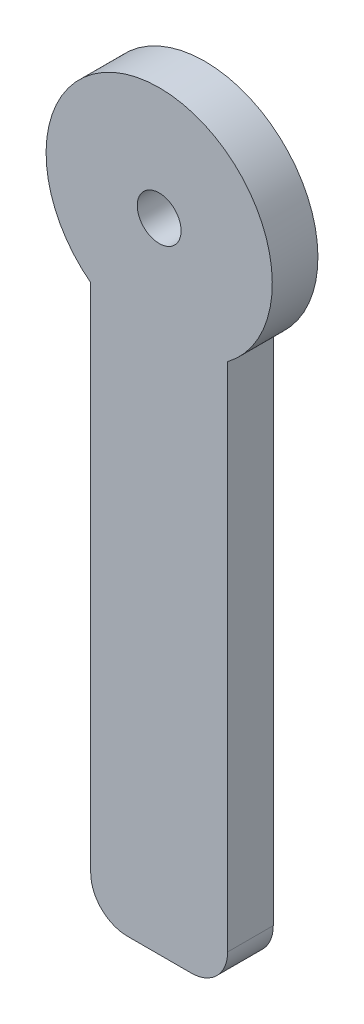
ISO-10303-21;
HEADER;
FILE_DESCRIPTION(('STEP AP214'),'2;1');
FILE_NAME('part.step','',(''),(''),'','','');
FILE_SCHEMA(('AUTOMOTIVE_DESIGN { 1 0 10303 214 1 1 1 1 }'));
ENDSEC;
DATA;
#1=APPLICATION_CONTEXT('core data for automotive mechanical design processes');
#2=APPLICATION_PROTOCOL_DEFINITION('international standard','automotive_design',2000,#1);
#3=PRODUCT_CONTEXT('',#1,'mechanical');
#4=PRODUCT('Part','Part','',(#3));
#5=PRODUCT_RELATED_PRODUCT_CATEGORY('part','',(#4));
#6=PRODUCT_DEFINITION_FORMATION('','',#4);
#7=PRODUCT_DEFINITION_CONTEXT('part definition',#1,'design');
#8=PRODUCT_DEFINITION('design','',#6,#7);
#9=PRODUCT_DEFINITION_SHAPE('','',#8);
#10=(LENGTH_UNIT() NAMED_UNIT(*) SI_UNIT(.MILLI.,.METRE.));
#11=(NAMED_UNIT(*) PLANE_ANGLE_UNIT() SI_UNIT($,.RADIAN.));
#12=(NAMED_UNIT(*) SI_UNIT($,.STERADIAN.) SOLID_ANGLE_UNIT());
#13=UNCERTAINTY_MEASURE_WITH_UNIT(LENGTH_MEASURE(1.E-05),#10,'distance_accuracy_value','');
#14=(GEOMETRIC_REPRESENTATION_CONTEXT(3) GLOBAL_UNCERTAINTY_ASSIGNED_CONTEXT((#13)) GLOBAL_UNIT_ASSIGNED_CONTEXT((#10,
#11,#12)) REPRESENTATION_CONTEXT('',''));
#15=CARTESIAN_POINT('',(0.,0.,0.));
#16=DIRECTION('',(0.,0.,1.));
#17=DIRECTION('',(1.,0.,0.));
#18=AXIS2_PLACEMENT_3D('',#15,#16,#17);
#19=CARTESIAN_POINT('',(-4.7625,44.362984271777,3.175));
#20=DIRECTION('',(0.,0.,-1.));
#21=DIRECTION('',(-1.,0.,0.));
#22=AXIS2_PLACEMENT_3D('',#19,#20,#21);
#23=CYLINDRICAL_SURFACE('',#22,7.86806064024209);
#24=CARTESIAN_POINT('',(-4.7625,44.362984271777,0.));
#25=DIRECTION('',(0.,0.,1.));
#26=DIRECTION('',(-1.,0.,0.));
#27=AXIS2_PLACEMENT_3D('',#24,#25,#26);
#28=CIRCLE('',#27,7.86806064024209);
#29=CARTESIAN_POINT('',(0.,38.1,0.));
#30=VERTEX_POINT('',#29);
#31=CARTESIAN_POINT('',(-9.525,38.1,0.));
#32=VERTEX_POINT('',#31);
#33=EDGE_CURVE('E128',#30,#32,#28,.T.);
#34=ORIENTED_EDGE('',*,*,#33,.T.);
#35=DIRECTION('',(0.,0.,-1.));
#36=VECTOR('',#35,1.);
#37=CARTESIAN_POINT('',(-9.525,38.1,3.175));
#38=LINE('',#37,#36);
#39=CARTESIAN_POINT('',(-9.525,38.1,3.175));
#40=VERTEX_POINT('',#39);
#41=EDGE_CURVE('E11',#40,#32,#38,.T.);
#42=ORIENTED_EDGE('',*,*,#41,.F.);
#43=CARTESIAN_POINT('',(-4.7625,44.362984271777,3.175));
#44=DIRECTION('',(0.,0.,1.));
#45=DIRECTION('',(-1.,0.,0.));
#46=AXIS2_PLACEMENT_3D('',#43,#44,#45);
#47=CIRCLE('',#46,7.86806064024209);
#48=CARTESIAN_POINT('',(0.,38.1,3.175));
#49=VERTEX_POINT('',#48);
#50=EDGE_CURVE('E145',#49,#40,#47,.T.);
#51=ORIENTED_EDGE('',*,*,#50,.F.);
#52=DIRECTION('',(0.,0.,-1.));
#53=VECTOR('',#52,1.);
#54=CARTESIAN_POINT('',(0.,38.1,3.175));
#55=LINE('',#54,#53);
#56=EDGE_CURVE('E124',#49,#30,#55,.T.);
#57=ORIENTED_EDGE('',*,*,#56,.T.);
#58=EDGE_LOOP('',(#34,#42,#51,#57));
#59=FACE_BOUND('',#58,.T.);
#60=ADVANCED_FACE('F39',(#59),#23,.T.);
#61=CARTESIAN_POINT('',(-9.525,2.54,3.175));
#62=DIRECTION('',(1.,0.,0.));
#63=DIRECTION('',(0.,1.,0.));
#64=AXIS2_PLACEMENT_3D('',#61,#62,#63);
#65=PLANE('',#64);
#66=DIRECTION('',(0.,-1.,0.));
#67=VECTOR('',#66,1.);
#68=CARTESIAN_POINT('',(-9.525,2.54,0.));
#69=LINE('',#68,#67);
#70=CARTESIAN_POINT('',(-9.525,2.54,0.));
#71=VERTEX_POINT('',#70);
#72=EDGE_CURVE('E132',#32,#71,#69,.T.);
#73=ORIENTED_EDGE('',*,*,#72,.T.);
#74=DIRECTION('',(0.,0.,-1.));
#75=VECTOR('',#74,1.);
#76=CARTESIAN_POINT('',(-9.525,2.54,3.175));
#77=LINE('',#76,#75);
#78=CARTESIAN_POINT('',(-9.525,2.54,3.175));
#79=VERTEX_POINT('',#78);
#80=EDGE_CURVE('E48',#79,#71,#77,.T.);
#81=ORIENTED_EDGE('',*,*,#80,.F.);
#82=DIRECTION('',(0.,-1.,0.));
#83=VECTOR('',#82,1.);
#84=CARTESIAN_POINT('',(-9.525,2.54,3.175));
#85=LINE('',#84,#83);
#86=EDGE_CURVE('E93',#40,#79,#85,.T.);
#87=ORIENTED_EDGE('',*,*,#86,.F.);
#88=ORIENTED_EDGE('',*,*,#41,.T.);
#89=EDGE_LOOP('',(#73,#81,#87,#88));
#90=FACE_BOUND('',#89,.T.);
#91=ADVANCED_FACE('F174',(#90),#65,.F.);
#92=CARTESIAN_POINT('',(-6.985,2.54,3.175));
#93=DIRECTION('',(0.,0.,-1.));
#94=DIRECTION('',(-1.,0.,0.));
#95=AXIS2_PLACEMENT_3D('',#92,#93,#94);
#96=CYLINDRICAL_SURFACE('',#95,2.54);
#97=CARTESIAN_POINT('',(-6.985,2.54,0.));
#98=DIRECTION('',(0.,0.,1.));
#99=DIRECTION('',(-1.,0.,0.));
#100=AXIS2_PLACEMENT_3D('',#97,#98,#99);
#101=CIRCLE('',#100,2.54);
#102=CARTESIAN_POINT('',(-6.985,0.,0.));
#103=VERTEX_POINT('',#102);
#104=EDGE_CURVE('E136',#71,#103,#101,.T.);
#105=ORIENTED_EDGE('',*,*,#104,.T.);
#106=DIRECTION('',(0.,0.,-1.));
#107=VECTOR('',#106,1.);
#108=CARTESIAN_POINT('',(-6.985,0.,3.175));
#109=LINE('',#108,#107);
#110=CARTESIAN_POINT('',(-6.985,0.,3.175));
#111=VERTEX_POINT('',#110);
#112=EDGE_CURVE('E117',#111,#103,#109,.T.);
#113=ORIENTED_EDGE('',*,*,#112,.F.);
#114=CARTESIAN_POINT('',(-6.985,2.54,3.175));
#115=DIRECTION('',(0.,0.,1.));
#116=DIRECTION('',(-1.,0.,0.));
#117=AXIS2_PLACEMENT_3D('',#114,#115,#116);
#118=CIRCLE('',#117,2.54);
#119=EDGE_CURVE('E106',#79,#111,#118,.T.);
#120=ORIENTED_EDGE('',*,*,#119,.F.);
#121=ORIENTED_EDGE('',*,*,#80,.T.);
#122=EDGE_LOOP('',(#105,#113,#120,#121));
#123=FACE_BOUND('',#122,.T.);
#124=ADVANCED_FACE('F155',(#123),#96,.T.);
#125=CARTESIAN_POINT('',(-2.54000000000002,0.,3.175));
#126=DIRECTION('',(0.,1.,0.));
#127=DIRECTION('',(-1.,0.,0.));
#128=AXIS2_PLACEMENT_3D('',#125,#126,#127);
#129=PLANE('',#128);
#130=DIRECTION('',(1.,0.,0.));
#131=VECTOR('',#130,1.);
#132=CARTESIAN_POINT('',(-2.54000000000002,0.,0.));
#133=LINE('',#132,#131);
#134=CARTESIAN_POINT('',(-2.54000000000002,0.,0.));
#135=VERTEX_POINT('',#134);
#136=EDGE_CURVE('E115',#103,#135,#133,.T.);
#137=ORIENTED_EDGE('',*,*,#136,.T.);
#138=DIRECTION('',(0.,0.,-1.));
#139=VECTOR('',#138,1.);
#140=CARTESIAN_POINT('',(-2.54000000000002,0.,3.175));
#141=LINE('',#140,#139);
#142=CARTESIAN_POINT('',(-2.54000000000002,0.,3.175));
#143=VERTEX_POINT('',#142);
#144=EDGE_CURVE('E112',#143,#135,#141,.T.);
#145=ORIENTED_EDGE('',*,*,#144,.F.);
#146=DIRECTION('',(1.,0.,0.));
#147=VECTOR('',#146,1.);
#148=CARTESIAN_POINT('',(-2.54000000000002,0.,3.175));
#149=LINE('',#148,#147);
#150=EDGE_CURVE('E100',#111,#143,#149,.T.);
#151=ORIENTED_EDGE('',*,*,#150,.F.);
#152=ORIENTED_EDGE('',*,*,#112,.T.);
#153=EDGE_LOOP('',(#137,#145,#151,#152));
#154=FACE_BOUND('',#153,.T.);
#155=ADVANCED_FACE('F113',(#154),#129,.F.);
#156=CARTESIAN_POINT('',(-2.54,2.54,3.175));
#157=DIRECTION('',(0.,0.,-1.));
#158=DIRECTION('',(-1.,0.,0.));
#159=AXIS2_PLACEMENT_3D('',#156,#157,#158);
#160=CYLINDRICAL_SURFACE('',#159,2.54);
#161=CARTESIAN_POINT('',(-2.54,2.54,0.));
#162=DIRECTION('',(0.,0.,1.));
#163=DIRECTION('',(1.,0.,0.));
#164=AXIS2_PLACEMENT_3D('',#161,#162,#163);
#165=CIRCLE('',#164,2.54);
#166=CARTESIAN_POINT('',(0.,2.54,0.));
#167=VERTEX_POINT('',#166);
#168=EDGE_CURVE('E79',#135,#167,#165,.T.);
#169=ORIENTED_EDGE('',*,*,#168,.T.);
#170=DIRECTION('',(0.,0.,-1.));
#171=VECTOR('',#170,1.);
#172=CARTESIAN_POINT('',(0.,2.54,3.175));
#173=LINE('',#172,#171);
#174=CARTESIAN_POINT('',(0.,2.54,3.175));
#175=VERTEX_POINT('',#174);
#176=EDGE_CURVE('E118',#175,#167,#173,.T.);
#177=ORIENTED_EDGE('',*,*,#176,.F.);
#178=CARTESIAN_POINT('',(-2.54,2.54,3.175));
#179=DIRECTION('',(0.,0.,1.));
#180=DIRECTION('',(1.,0.,0.));
#181=AXIS2_PLACEMENT_3D('',#178,#179,#180);
#182=CIRCLE('',#181,2.54);
#183=EDGE_CURVE('E104',#143,#175,#182,.T.);
#184=ORIENTED_EDGE('',*,*,#183,.F.);
#185=ORIENTED_EDGE('',*,*,#144,.T.);
#186=EDGE_LOOP('',(#169,#177,#184,#185));
#187=FACE_BOUND('',#186,.T.);
#188=ADVANCED_FACE('F120',(#187),#160,.T.);
#189=CARTESIAN_POINT('',(0.,2.54000000000002,3.175));
#190=DIRECTION('',(-1.,0.,0.));
#191=DIRECTION('',(0.,-1.,0.));
#192=AXIS2_PLACEMENT_3D('',#189,#190,#191);
#193=PLANE('',#192);
#194=DIRECTION('',(0.,1.,0.));
#195=VECTOR('',#194,1.);
#196=CARTESIAN_POINT('',(0.,2.54000000000002,0.));
#197=LINE('',#196,#195);
#198=EDGE_CURVE('E85',#167,#30,#197,.T.);
#199=ORIENTED_EDGE('',*,*,#198,.T.);
#200=ORIENTED_EDGE('',*,*,#56,.F.);
#201=DIRECTION('',(0.,1.,0.));
#202=VECTOR('',#201,1.);
#203=CARTESIAN_POINT('',(0.,2.54000000000002,3.175));
#204=LINE('',#203,#202);
#205=EDGE_CURVE('E56',#175,#49,#204,.T.);
#206=ORIENTED_EDGE('',*,*,#205,.F.);
#207=ORIENTED_EDGE('',*,*,#176,.T.);
#208=EDGE_LOOP('',(#199,#200,#206,#207));
#209=FACE_BOUND('',#208,.T.);
#210=ADVANCED_FACE('F162',(#209),#193,.F.);
#211=CARTESIAN_POINT('',(-4.7625,44.362984271777,3.175));
#212=DIRECTION('',(0.,0.,-1.));
#213=DIRECTION('',(-1.,0.,0.));
#214=AXIS2_PLACEMENT_3D('',#211,#212,#213);
#215=PLANE('',#214);
#216=CARTESIAN_POINT('',(-4.7625,44.362984271777,3.175));
#217=DIRECTION('',(0.,0.,1.));
#218=DIRECTION('',(1.,0.,0.));
#219=AXIS2_PLACEMENT_3D('',#216,#217,#218);
#220=CIRCLE('',#219,1.524);
#221=CARTESIAN_POINT('',(-3.2385,44.362984271777,3.175));
#222=VERTEX_POINT('',#221);
#223=EDGE_CURVE('E229',#222,#222,#220,.T.);
#224=ORIENTED_EDGE('',*,*,#223,.F.);
#225=EDGE_LOOP('',(#224));
#226=FACE_BOUND('',#225,.T.);
#227=ORIENTED_EDGE('',*,*,#50,.T.);
#228=ORIENTED_EDGE('',*,*,#86,.T.);
#229=ORIENTED_EDGE('',*,*,#119,.T.);
#230=ORIENTED_EDGE('',*,*,#150,.T.);
#231=ORIENTED_EDGE('',*,*,#183,.T.);
#232=ORIENTED_EDGE('',*,*,#205,.T.);
#233=EDGE_LOOP('',(#227,#228,#229,#230,#231,#232));
#234=FACE_BOUND('',#233,.T.);
#235=ADVANCED_FACE('F102',(#226,#234),#215,.F.);
#236=CARTESIAN_POINT('',(-4.7625,44.362984271777,0.));
#237=DIRECTION('',(0.,0.,-1.));
#238=DIRECTION('',(-1.,0.,0.));
#239=AXIS2_PLACEMENT_3D('',#236,#237,#238);
#240=PLANE('',#239);
#241=CARTESIAN_POINT('',(-4.7625,44.362984271777,0.));
#242=DIRECTION('',(0.,0.,1.));
#243=DIRECTION('',(1.,0.,0.));
#244=AXIS2_PLACEMENT_3D('',#241,#242,#243);
#245=CIRCLE('',#244,1.524);
#246=CARTESIAN_POINT('',(-3.2385,44.362984271777,0.));
#247=VERTEX_POINT('',#246);
#248=EDGE_CURVE('E133',#247,#247,#245,.T.);
#249=ORIENTED_EDGE('',*,*,#248,.T.);
#250=EDGE_LOOP('',(#249));
#251=FACE_BOUND('',#250,.T.);
#252=ORIENTED_EDGE('',*,*,#33,.F.);
#253=ORIENTED_EDGE('',*,*,#198,.F.);
#254=ORIENTED_EDGE('',*,*,#168,.F.);
#255=ORIENTED_EDGE('',*,*,#136,.F.);
#256=ORIENTED_EDGE('',*,*,#104,.F.);
#257=ORIENTED_EDGE('',*,*,#72,.F.);
#258=EDGE_LOOP('',(#252,#253,#254,#255,#256,#257));
#259=FACE_BOUND('',#258,.T.);
#260=ADVANCED_FACE('F158',(#251,#259),#240,.T.);
#261=CARTESIAN_POINT('',(-4.7625,44.362984271777,0.));
#262=DIRECTION('',(0.,0.,1.));
#263=DIRECTION('',(1.,0.,0.));
#264=AXIS2_PLACEMENT_3D('',#261,#262,#263);
#265=CYLINDRICAL_SURFACE('',#264,1.524);
#266=ORIENTED_EDGE('',*,*,#248,.F.);
#267=EDGE_LOOP('',(#266));
#268=FACE_BOUND('',#267,.T.);
#269=ORIENTED_EDGE('',*,*,#223,.T.);
#270=EDGE_LOOP('',(#269));
#271=FACE_BOUND('',#270,.T.);
#272=ADVANCED_FACE('F211',(#268,#271),#265,.F.);
#273=CLOSED_SHELL('',(#60,#91,#124,#155,#188,#210,#235,#260,#272));
#274=MANIFOLD_SOLID_BREP('B2',#273);
#275=ADVANCED_BREP_SHAPE_REPRESENTATION('',(#18,#274),#14);
#276=SHAPE_DEFINITION_REPRESENTATION(#9,#275);
ENDSEC;
END-ISO-10303-21;
